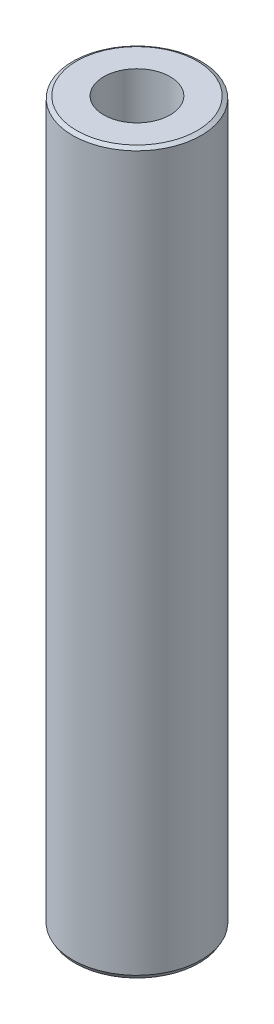
ISO-10303-21;
HEADER;
FILE_DESCRIPTION(('STEP AP214'),'2;1');
FILE_NAME('part.step','',(''),(''),'','','');
FILE_SCHEMA(('AUTOMOTIVE_DESIGN { 1 0 10303 214 1 1 1 1 }'));
ENDSEC;
DATA;
#1=APPLICATION_CONTEXT('core data for automotive mechanical design processes');
#2=APPLICATION_PROTOCOL_DEFINITION('international standard','automotive_design',2000,#1);
#3=PRODUCT_CONTEXT('',#1,'mechanical');
#4=PRODUCT('Part','Part','',(#3));
#5=PRODUCT_RELATED_PRODUCT_CATEGORY('part','',(#4));
#6=PRODUCT_DEFINITION_FORMATION('','',#4);
#7=PRODUCT_DEFINITION_CONTEXT('part definition',#1,'design');
#8=PRODUCT_DEFINITION('design','',#6,#7);
#9=PRODUCT_DEFINITION_SHAPE('','',#8);
#10=(LENGTH_UNIT() NAMED_UNIT(*) SI_UNIT(.MILLI.,.METRE.));
#11=(NAMED_UNIT(*) PLANE_ANGLE_UNIT() SI_UNIT($,.RADIAN.));
#12=(NAMED_UNIT(*) SI_UNIT($,.STERADIAN.) SOLID_ANGLE_UNIT());
#13=UNCERTAINTY_MEASURE_WITH_UNIT(LENGTH_MEASURE(1.E-05),#10,'distance_accuracy_value','');
#14=(GEOMETRIC_REPRESENTATION_CONTEXT(3) GLOBAL_UNCERTAINTY_ASSIGNED_CONTEXT((#13)) GLOBAL_UNIT_ASSIGNED_CONTEXT((#10,
#11,#12)) REPRESENTATION_CONTEXT('',''));
#15=CARTESIAN_POINT('',(0.,0.,0.));
#16=DIRECTION('',(0.,0.,1.));
#17=DIRECTION('',(1.,0.,0.));
#18=AXIS2_PLACEMENT_3D('',#15,#16,#17);
#19=CARTESIAN_POINT('',(0.,392.496078714362,0.));
#20=DIRECTION('',(0.,-1.,0.));
#21=DIRECTION('',(0.,0.,-1.));
#22=AXIS2_PLACEMENT_3D('',#19,#20,#21);
#23=CYLINDRICAL_SURFACE('',#22,35.);
#24=CARTESIAN_POINT('',(0.,391.258582956489,0.));
#25=DIRECTION('',(0.,1.,0.));
#26=DIRECTION('',(0.,0.,1.));
#27=AXIS2_PLACEMENT_3D('',#24,#25,#26);
#28=CIRCLE('',#27,35.);
#29=CARTESIAN_POINT('',(0.,391.258582956489,35.));
#30=VERTEX_POINT('',#29);
#31=EDGE_CURVE('E50',#30,#30,#28,.F.);
#32=ORIENTED_EDGE('',*,*,#31,.T.);
#33=EDGE_LOOP('',(#32));
#34=FACE_BOUND('',#33,.T.);
#35=CARTESIAN_POINT('',(0.,2.14340552678699,0.));
#36=DIRECTION('',(0.,1.,0.));
#37=DIRECTION('',(0.,0.,1.));
#38=AXIS2_PLACEMENT_3D('',#35,#36,#37);
#39=CIRCLE('',#38,35.);
#40=CARTESIAN_POINT('',(0.,2.14340552678699,35.));
#41=VERTEX_POINT('',#40);
#42=EDGE_CURVE('E51',#41,#41,#39,.T.);
#43=ORIENTED_EDGE('',*,*,#42,.T.);
#44=EDGE_LOOP('',(#43));
#45=FACE_BOUND('',#44,.T.);
#46=ADVANCED_FACE('F39',(#34,#45),#23,.T.);
#47=CARTESIAN_POINT('',(0.,392.496078714362,0.));
#48=DIRECTION('',(0.,1.,0.));
#49=DIRECTION('',(0.,0.,1.));
#50=AXIS2_PLACEMENT_3D('',#47,#48,#49);
#51=PLANE('',#50);
#52=CARTESIAN_POINT('',(0.,392.496078714362,0.));
#53=DIRECTION('',(0.,1.,0.));
#54=DIRECTION('',(0.,0.,1.));
#55=AXIS2_PLACEMENT_3D('',#52,#53,#54);
#56=CIRCLE('',#55,32.8565944732131);
#57=CARTESIAN_POINT('',(0.,392.496078714362,32.8565944732131));
#58=VERTEX_POINT('',#57);
#59=EDGE_CURVE('E54',#58,#58,#56,.T.);
#60=ORIENTED_EDGE('',*,*,#59,.T.);
#61=EDGE_LOOP('',(#60));
#62=FACE_BOUND('',#61,.T.);
#63=CARTESIAN_POINT('',(0.,392.496078714362,0.));
#64=DIRECTION('',(0.,1.,0.));
#65=DIRECTION('',(0.,0.,1.));
#66=AXIS2_PLACEMENT_3D('',#63,#64,#65);
#67=CIRCLE('',#66,18.0884742409328);
#68=CARTESIAN_POINT('',(0.,392.496078714362,18.0884742409328));
#69=VERTEX_POINT('',#68);
#70=EDGE_CURVE('E58',#69,#69,#67,.T.);
#71=ORIENTED_EDGE('',*,*,#70,.F.);
#72=EDGE_LOOP('',(#71));
#73=FACE_BOUND('',#72,.T.);
#74=ADVANCED_FACE('F69',(#62,#73),#51,.T.);
#75=CARTESIAN_POINT('',(0.,0.,0.));
#76=DIRECTION('',(0.,1.,0.));
#77=DIRECTION('',(0.,0.,1.));
#78=AXIS2_PLACEMENT_3D('',#75,#76,#77);
#79=PLANE('',#78);
#80=CARTESIAN_POINT('',(0.,0.,0.));
#81=DIRECTION('',(0.,1.,0.));
#82=DIRECTION('',(0.,0.,1.));
#83=AXIS2_PLACEMENT_3D('',#80,#81,#82);
#84=CIRCLE('',#83,33.762504242127);
#85=CARTESIAN_POINT('',(0.,0.,33.762504242127));
#86=VERTEX_POINT('',#85);
#87=EDGE_CURVE('E10',#86,#86,#84,.F.);
#88=ORIENTED_EDGE('',*,*,#87,.T.);
#89=EDGE_LOOP('',(#88));
#90=FACE_BOUND('',#89,.T.);
#91=CARTESIAN_POINT('',(0.,0.,0.));
#92=DIRECTION('',(0.,1.,0.));
#93=DIRECTION('',(0.,0.,1.));
#94=AXIS2_PLACEMENT_3D('',#91,#92,#93);
#95=CIRCLE('',#94,18.0884742409328);
#96=CARTESIAN_POINT('',(0.,0.,18.0884742409328));
#97=VERTEX_POINT('',#96);
#98=EDGE_CURVE('E63',#97,#97,#95,.T.);
#99=ORIENTED_EDGE('',*,*,#98,.T.);
#100=EDGE_LOOP('',(#99));
#101=FACE_BOUND('',#100,.T.);
#102=ADVANCED_FACE('F75',(#90,#101),#79,.F.);
#103=CARTESIAN_POINT('',(0.,392.496078714362,0.));
#104=DIRECTION('',(0.,-1.,0.));
#105=DIRECTION('',(0.,0.,-1.));
#106=AXIS2_PLACEMENT_3D('',#103,#104,#105);
#107=CYLINDRICAL_SURFACE('',#106,18.0884742409328);
#108=ORIENTED_EDGE('',*,*,#70,.T.);
#109=EDGE_LOOP('',(#108));
#110=FACE_BOUND('',#109,.T.);
#111=ORIENTED_EDGE('',*,*,#98,.F.);
#112=EDGE_LOOP('',(#111));
#113=FACE_BOUND('',#112,.T.);
#114=ADVANCED_FACE('F70',(#110,#113),#107,.F.);
#115=CARTESIAN_POINT('',(0.,392.496078714362,0.));
#116=DIRECTION('',(0.,-1.,0.));
#117=DIRECTION('',(0.,0.,-1.));
#118=AXIS2_PLACEMENT_3D('',#115,#116,#117);
#119=CONICAL_SURFACE('',#118,32.8565944732131,1.0471975511966);
#120=ORIENTED_EDGE('',*,*,#31,.F.);
#121=EDGE_LOOP('',(#120));
#122=FACE_BOUND('',#121,.T.);
#123=ORIENTED_EDGE('',*,*,#59,.F.);
#124=EDGE_LOOP('',(#123));
#125=FACE_BOUND('',#124,.T.);
#126=ADVANCED_FACE('F81',(#122,#125),#119,.T.);
#127=CARTESIAN_POINT('',(0.,2.14340552678699,0.));
#128=DIRECTION('',(0.,1.,0.));
#129=DIRECTION('',(0.,0.,1.));
#130=AXIS2_PLACEMENT_3D('',#127,#128,#129);
#131=CONICAL_SURFACE('',#130,35.,0.523598775598308);
#132=ORIENTED_EDGE('',*,*,#87,.F.);
#133=EDGE_LOOP('',(#132));
#134=FACE_BOUND('',#133,.T.);
#135=ORIENTED_EDGE('',*,*,#42,.F.);
#136=EDGE_LOOP('',(#135));
#137=FACE_BOUND('',#136,.T.);
#138=ADVANCED_FACE('F45',(#134,#137),#131,.T.);
#139=CLOSED_SHELL('',(#46,#74,#102,#114,#126,#138));
#140=MANIFOLD_SOLID_BREP('B2',#139);
#141=ADVANCED_BREP_SHAPE_REPRESENTATION('',(#18,#140),#14);
#142=SHAPE_DEFINITION_REPRESENTATION(#9,#141);
ENDSEC;
END-ISO-10303-21;
